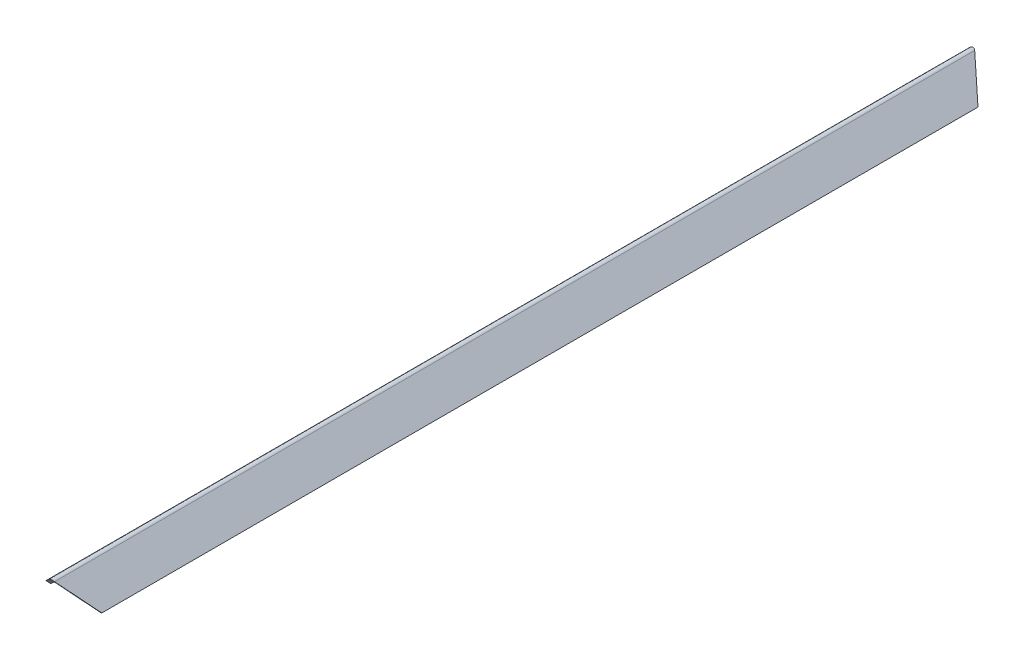
ISO-10303-21;
HEADER;
FILE_DESCRIPTION(('STEP AP214'),'2;1');
FILE_NAME('part.step','',(''),(''),'','','');
FILE_SCHEMA(('AUTOMOTIVE_DESIGN { 1 0 10303 214 1 1 1 1 }'));
ENDSEC;
DATA;
#1=APPLICATION_CONTEXT('core data for automotive mechanical design processes');
#2=APPLICATION_PROTOCOL_DEFINITION('international standard','automotive_design',2000,#1);
#3=PRODUCT_CONTEXT('',#1,'mechanical');
#4=PRODUCT('Part','Part','',(#3));
#5=PRODUCT_RELATED_PRODUCT_CATEGORY('part','',(#4));
#6=PRODUCT_DEFINITION_FORMATION('','',#4);
#7=PRODUCT_DEFINITION_CONTEXT('part definition',#1,'design');
#8=PRODUCT_DEFINITION('design','',#6,#7);
#9=PRODUCT_DEFINITION_SHAPE('','',#8);
#10=(LENGTH_UNIT() NAMED_UNIT(*) SI_UNIT(.MILLI.,.METRE.));
#11=(NAMED_UNIT(*) PLANE_ANGLE_UNIT() SI_UNIT($,.RADIAN.));
#12=(NAMED_UNIT(*) SI_UNIT($,.STERADIAN.) SOLID_ANGLE_UNIT());
#13=UNCERTAINTY_MEASURE_WITH_UNIT(LENGTH_MEASURE(1.E-05),#10,'distance_accuracy_value','');
#14=(GEOMETRIC_REPRESENTATION_CONTEXT(3) GLOBAL_UNCERTAINTY_ASSIGNED_CONTEXT((#13)) GLOBAL_UNIT_ASSIGNED_CONTEXT((#10,
#11,#12)) REPRESENTATION_CONTEXT('',''));
#15=CARTESIAN_POINT('',(0.,0.,0.));
#16=DIRECTION('',(0.,0.,1.));
#17=DIRECTION('',(1.,0.,0.));
#18=AXIS2_PLACEMENT_3D('',#15,#16,#17);
#19=CARTESIAN_POINT('',(-43.8794512837076,-42.2312162004582,1631.95));
#20=DIRECTION('',(-0.70654003930833,0.707673069188156,0.));
#21=DIRECTION('',(-0.707673069188156,-0.70654003930833,0.));
#22=AXIS2_PLACEMENT_3D('',#19,#20,#21);
#23=PLANE('',#22);
#24=DIRECTION('',(0.,0.,-1.));
#25=VECTOR('',#24,1.);
#26=CARTESIAN_POINT('',(-43.8794512837076,-42.2312162004582,1631.95));
#27=LINE('',#26,#25);
#28=CARTESIAN_POINT('',(-43.8794512837076,-42.2312162004582,1587.5));
#29=VERTEX_POINT('',#28);
#30=CARTESIAN_POINT('',(-43.8794512837076,-42.2312162004582,44.4499999999999));
#31=VERTEX_POINT('',#30);
#32=EDGE_CURVE('E126',#29,#31,#27,.T.);
#33=ORIENTED_EDGE('',*,*,#32,.T.);
#34=DIRECTION('',(0.603062993340039,0.602097450887426,-0.523252984414438));
#35=VECTOR('',#34,1.);
#36=CARTESIAN_POINT('',(-544.822237583646,-542.371961035667,479.097476046553));
#37=LINE('',#36,#35);
#38=CARTESIAN_POINT('',(-0.724615856394828,0.854525573122378,7.00632217756897));
#39=VERTEX_POINT('',#38);
#40=EDGE_CURVE('E56',#31,#39,#37,.T.);
#41=ORIENTED_EDGE('',*,*,#40,.T.);
#42=DIRECTION('',(0.,0.,-1.));
#43=VECTOR('',#42,1.);
#44=CARTESIAN_POINT('',(-0.724615856394798,0.854525573122322,1631.95));
#45=LINE('',#44,#43);
#46=CARTESIAN_POINT('',(-0.7246158563948,0.854525573122329,1624.94367782243));
#47=VERTEX_POINT('',#46);
#48=EDGE_CURVE('E11',#47,#39,#45,.T.);
#49=ORIENTED_EDGE('',*,*,#48,.F.);
#50=DIRECTION('',(-0.603062993340038,-0.602097450887426,-0.523252984414439));
#51=VECTOR('',#50,1.);
#52=CARTESIAN_POINT('',(-29.853053267309,-28.227275345072,1599.6701293293));
#53=LINE('',#52,#51);
#54=EDGE_CURVE('E176',#47,#29,#53,.T.);
#55=ORIENTED_EDGE('',*,*,#54,.T.);
#56=EDGE_LOOP('',(#33,#41,#49,#55));
#57=FACE_BOUND('',#56,.T.);
#58=ADVANCED_FACE('F41',(#57),#23,.F.);
#59=CARTESIAN_POINT('',(1.06999584344836,-0.942964022615596,1631.95));
#60=DIRECTION('',(0.,0.,-1.));
#61=DIRECTION('',(-1.,0.,0.));
#62=AXIS2_PLACEMENT_3D('',#59,#60,#61);
#63=CYLINDRICAL_SURFACE('',#62,2.54);
#64=ORIENTED_EDGE('',*,*,#48,.T.);
#65=CARTESIAN_POINT('',(1.06999584344836,-0.942964022615596,8.56168526678269));
#66=DIRECTION('',(0.00141766130242952,0.655147382128327,0.755499766993234));
#67=DIRECTION('',(0.00163480814450312,0.755497998229752,-0.655148915952067));
#68=AXIS2_PLACEMENT_3D('',#65,#66,#67);
#69=ELLIPSE('',#68,3.36201294953245,2.54);
#70=CARTESIAN_POINT('',(2.86992929570218,0.849196563787902,7.00419833701027));
#71=VERTEX_POINT('',#70);
#72=EDGE_CURVE('E161',#39,#71,#69,.F.);
#73=ORIENTED_EDGE('',*,*,#72,.T.);
#74=DIRECTION('',(0.,0.,-1.));
#75=VECTOR('',#74,1.);
#76=CARTESIAN_POINT('',(2.86992929570198,0.849196563787973,1631.95));
#77=LINE('',#76,#75);
#78=CARTESIAN_POINT('',(2.86992929570196,0.849196563787975,1624.94580166299));
#79=VERTEX_POINT('',#78);
#80=EDGE_CURVE('E49',#79,#71,#77,.T.);
#81=ORIENTED_EDGE('',*,*,#80,.F.);
#82=CARTESIAN_POINT('',(1.06999584344836,-0.942964022615596,1623.38831473322));
#83=DIRECTION('',(0.00141766130242964,0.655147382128328,-0.755499766993233));
#84=DIRECTION('',(-0.00163480814450325,-0.755497998229751,-0.655148915952068));
#85=AXIS2_PLACEMENT_3D('',#82,#83,#84);
#86=ELLIPSE('',#85,3.36201294953246,2.54);
#87=EDGE_CURVE('E132',#79,#47,#86,.F.);
#88=ORIENTED_EDGE('',*,*,#87,.T.);
#89=EDGE_LOOP('',(#64,#73,#81,#88));
#90=FACE_BOUND('',#89,.T.);
#91=ADVANCED_FACE('F159',(#90),#63,.F.);
#92=CARTESIAN_POINT('',(45.9578606188247,-42.4256134980323,1631.95));
#93=DIRECTION('',(0.708635217422683,0.705575034017153,0.));
#94=DIRECTION('',(-0.705575034017153,0.708635217422683,0.));
#95=AXIS2_PLACEMENT_3D('',#92,#93,#94);
#96=PLANE('',#95);
#97=ORIENTED_EDGE('',*,*,#80,.T.);
#98=DIRECTION('',(0.601498945856209,-0.604107735855584,0.522735938704533));
#99=VECTOR('',#98,1.);
#100=CARTESIAN_POINT('',(545.107732414767,-543.740372203091,478.238917811129));
#101=LINE('',#100,#99);
#102=CARTESIAN_POINT('',(45.9578606188247,-42.4256134980324,44.4499999999999));
#103=VERTEX_POINT('',#102);
#104=EDGE_CURVE('E154',#71,#103,#101,.T.);
#105=ORIENTED_EDGE('',*,*,#104,.T.);
#106=DIRECTION('',(0.,0.,-1.));
#107=VECTOR('',#106,1.);
#108=CARTESIAN_POINT('',(45.9578606188247,-42.4256134980323,1631.95));
#109=LINE('',#108,#107);
#110=CARTESIAN_POINT('',(45.9578606188247,-42.4256134980323,1587.5));
#111=VERTEX_POINT('',#110);
#112=EDGE_CURVE('E143',#111,#103,#109,.T.);
#113=ORIENTED_EDGE('',*,*,#112,.F.);
#114=DIRECTION('',(-0.601498945856208,0.604107735855584,0.522735938704534));
#115=VECTOR('',#114,1.);
#116=CARTESIAN_POINT('',(31.9816642085379,-28.3888002542904,1599.64608969871));
#117=LINE('',#116,#115);
#118=EDGE_CURVE('E155',#111,#79,#117,.T.);
#119=ORIENTED_EDGE('',*,*,#118,.T.);
#120=EDGE_LOOP('',(#97,#105,#113,#119));
#121=FACE_BOUND('',#120,.T.);
#122=ADVANCED_FACE('F152',(#121),#96,.F.);
#123=CARTESIAN_POINT('',(50.4576942494587,-37.9452120320234,1631.95));
#124=DIRECTION('',(-0.705575034017152,0.708635217422684,0.));
#125=DIRECTION('',(-0.708635217422684,-0.705575034017152,0.));
#126=AXIS2_PLACEMENT_3D('',#123,#124,#125);
#127=PLANE('',#126);
#128=ORIENTED_EDGE('',*,*,#112,.T.);
#129=DIRECTION('',(0.604107735855586,0.601498945856208,-0.522735938704532));
#130=VECTOR('',#129,1.);
#131=CARTESIAN_POINT('',(-452.086656871955,-538.319366349728,475.409169887911));
#132=LINE('',#131,#130);
#133=CARTESIAN_POINT('',(50.4576942494588,-37.9452120320234,40.5562826755692));
#134=VERTEX_POINT('',#133);
#135=EDGE_CURVE('E167',#103,#134,#132,.T.);
#136=ORIENTED_EDGE('',*,*,#135,.T.);
#137=DIRECTION('',(0.,0.,-1.));
#138=VECTOR('',#137,1.);
#139=CARTESIAN_POINT('',(50.4576942494587,-37.9452120320234,1631.95));
#140=LINE('',#139,#138);
#141=CARTESIAN_POINT('',(50.4576942494587,-37.9452120320234,1591.39371732443));
#142=VERTEX_POINT('',#141);
#143=EDGE_CURVE('E139',#142,#134,#140,.T.);
#144=ORIENTED_EDGE('',*,*,#143,.F.);
#145=DIRECTION('',(-0.604107735855585,-0.601498945856207,-0.522735938704533));
#146=VECTOR('',#145,1.);
#147=CARTESIAN_POINT('',(63.2649150768462,-25.1932981435001,1602.47583762193));
#148=LINE('',#147,#146);
#149=EDGE_CURVE('E184',#142,#111,#148,.T.);
#150=ORIENTED_EDGE('',*,*,#149,.T.);
#151=EDGE_LOOP('',(#128,#136,#144,#150));
#152=FACE_BOUND('',#151,.T.);
#153=ADVANCED_FACE('F192',(#152),#127,.F.);
#154=CARTESIAN_POINT('',(50.4576942494587,-37.9452120320234,1631.95));
#155=DIRECTION('',(-0.708635217422683,-0.705575034017153,0.));
#156=DIRECTION('',(0.705575034017153,-0.708635217422683,0.));
#157=AXIS2_PLACEMENT_3D('',#154,#155,#156);
#158=PLANE('',#157);
#159=ORIENTED_EDGE('',*,*,#143,.T.);
#160=DIRECTION('',(-0.601498945856208,0.604107735855584,-0.522735938704533));
#161=VECTOR('',#160,1.);
#162=CARTESIAN_POINT('',(550.831848567165,-540.489563153436,475.409169887912));
#163=LINE('',#162,#161);
#164=CARTESIAN_POINT('',(5.65367958936952,7.05312427431696,1.61910943125854));
#165=VERTEX_POINT('',#164);
#166=EDGE_CURVE('E200',#134,#165,#163,.T.);
#167=ORIENTED_EDGE('',*,*,#166,.T.);
#168=DIRECTION('',(0.,0.,-1.));
#169=VECTOR('',#168,1.);
#170=CARTESIAN_POINT('',(5.65367958936952,7.05312427431696,1631.95));
#171=LINE('',#170,#169);
#172=CARTESIAN_POINT('',(5.65367958936952,7.05312427431696,1630.33089056874));
#173=VERTEX_POINT('',#172);
#174=EDGE_CURVE('E130',#173,#165,#171,.T.);
#175=ORIENTED_EDGE('',*,*,#174,.F.);
#176=DIRECTION('',(0.601498945856208,-0.604107735855584,-0.522735938704534));
#177=VECTOR('',#176,1.);
#178=CARTESIAN_POINT('',(37.7057803609354,-25.137991204636,1602.47583762193));
#179=LINE('',#178,#177);
#180=EDGE_CURVE('E180',#173,#142,#179,.T.);
#181=ORIENTED_EDGE('',*,*,#180,.T.);
#182=EDGE_LOOP('',(#159,#167,#175,#181));
#183=FACE_BOUND('',#182,.T.);
#184=ADVANCED_FACE('F198',(#183),#158,.F.);
#185=CARTESIAN_POINT('',(1.13632766502265,2.5552801659182,1631.95));
#186=DIRECTION('',(0.,0.,-1.));
#187=DIRECTION('',(-1.,0.,0.));
#188=AXIS2_PLACEMENT_3D('',#185,#186,#187);
#189=CYLINDRICAL_SURFACE('',#188,6.37472117287162);
#190=CARTESIAN_POINT('',(1.13632766502265,2.5552801659182,5.52798537916832));
#191=DIRECTION('',(0.00141766130242952,0.655147382128327,0.755499766993234));
#192=DIRECTION('',(0.00163480814450312,0.755497998229752,-0.655148915952067));
#193=AXIS2_PLACEMENT_3D('',#190,#191,#192);
#194=ELLIPSE('',#193,8.43775398931223,6.37472117287162);
#195=CARTESIAN_POINT('',(-3.36151644337612,7.07263209026499,1.61910943125848));
#196=VERTEX_POINT('',#195);
#197=EDGE_CURVE('E203',#165,#196,#194,.T.);
#198=ORIENTED_EDGE('',*,*,#197,.T.);
#199=DIRECTION('',(0.,0.,-1.));
#200=VECTOR('',#199,1.);
#201=CARTESIAN_POINT('',(-3.36151644337611,7.07263209026506,1631.95));
#202=LINE('',#201,#200);
#203=CARTESIAN_POINT('',(-3.3615164433761,7.07263209026507,1630.33089056874));
#204=VERTEX_POINT('',#203);
#205=EDGE_CURVE('E120',#204,#196,#202,.T.);
#206=ORIENTED_EDGE('',*,*,#205,.F.);
#207=CARTESIAN_POINT('',(1.13632766502265,2.5552801659182,1626.42201462083));
#208=DIRECTION('',(0.00141766130242964,0.655147382128328,-0.755499766993233));
#209=DIRECTION('',(-0.00163480814450325,-0.755497998229751,-0.655148915952068));
#210=AXIS2_PLACEMENT_3D('',#207,#208,#209);
#211=ELLIPSE('',#210,8.43775398931224,6.37472117287162);
#212=EDGE_CURVE('E173',#204,#173,#211,.T.);
#213=ORIENTED_EDGE('',*,*,#212,.T.);
#214=ORIENTED_EDGE('',*,*,#174,.T.);
#215=EDGE_LOOP('',(#198,#206,#213,#214));
#216=FACE_BOUND('',#215,.T.);
#217=ADVANCED_FACE('F202',(#216),#189,.T.);
#218=CARTESIAN_POINT('',(-48.3598527497165,-37.7313825698242,1631.95));
#219=DIRECTION('',(0.705575034017153,-0.708635217422683,0.));
#220=DIRECTION('',(0.708635217422683,0.705575034017153,0.));
#221=AXIS2_PLACEMENT_3D('',#218,#219,#220);
#222=PLANE('',#221);
#223=ORIENTED_EDGE('',*,*,#205,.T.);
#224=DIRECTION('',(-0.604107735855584,-0.601498945856209,0.522735938704533));
#225=VECTOR('',#224,1.);
#226=CARTESIAN_POINT('',(-550.904203871129,-538.10553688753,475.409169887912));
#227=LINE('',#226,#225);
#228=CARTESIAN_POINT('',(-48.3598527497164,-37.7313825698242,40.5562826755689));
#229=VERTEX_POINT('',#228);
#230=EDGE_CURVE('E107',#196,#229,#227,.T.);
#231=ORIENTED_EDGE('',*,*,#230,.T.);
#232=DIRECTION('',(0.,0.,-1.));
#233=VECTOR('',#232,1.);
#234=CARTESIAN_POINT('',(-48.3598527497165,-37.7313825698242,1631.95));
#235=LINE('',#234,#233);
#236=CARTESIAN_POINT('',(-48.3598527497165,-37.7313825698242,1591.39371732443));
#237=VERTEX_POINT('',#236);
#238=EDGE_CURVE('E118',#237,#229,#235,.T.);
#239=ORIENTED_EDGE('',*,*,#238,.F.);
#240=DIRECTION('',(0.604107735855584,0.601498945856208,0.522735938704534));
#241=VECTOR('',#240,1.);
#242=CARTESIAN_POINT('',(-35.5526319223291,-24.9794686813009,1602.47583762193));
#243=LINE('',#242,#241);
#244=EDGE_CURVE('E64',#237,#204,#243,.T.);
#245=ORIENTED_EDGE('',*,*,#244,.T.);
#246=EDGE_LOOP('',(#223,#231,#239,#245));
#247=FACE_BOUND('',#246,.T.);
#248=ADVANCED_FACE('F117',(#247),#222,.F.);
#249=CARTESIAN_POINT('',(-43.8794512837076,-42.2312162004582,1631.95));
#250=DIRECTION('',(0.708635217422683,0.705575034017153,0.));
#251=DIRECTION('',(-0.705575034017153,0.708635217422683,0.));
#252=AXIS2_PLACEMENT_3D('',#249,#250,#251);
#253=PLANE('',#252);
#254=ORIENTED_EDGE('',*,*,#238,.T.);
#255=DIRECTION('',(0.601498945856208,-0.604107735855584,0.522735938704533));
#256=VECTOR('',#255,1.);
#257=CARTESIAN_POINT('',(455.270420512235,-543.545974905517,478.238917811129));
#258=LINE('',#257,#256);
#259=EDGE_CURVE('E104',#229,#31,#258,.T.);
#260=ORIENTED_EDGE('',*,*,#259,.T.);
#261=ORIENTED_EDGE('',*,*,#32,.F.);
#262=DIRECTION('',(-0.601498945856208,0.604107735855584,0.522735938704534));
#263=VECTOR('',#262,1.);
#264=CARTESIAN_POINT('',(-57.8556476939943,-28.1944029567162,1599.64608969871));
#265=LINE('',#264,#263);
#266=EDGE_CURVE('E124',#29,#237,#265,.T.);
#267=ORIENTED_EDGE('',*,*,#266,.T.);
#268=EDGE_LOOP('',(#254,#260,#261,#267));
#269=FACE_BOUND('',#268,.T.);
#270=ADVANCED_FACE('F123',(#269),#253,.F.);
#271=CARTESIAN_POINT('',(-1.73959199251768,-803.922021371478,927.063003524163));
#272=DIRECTION('',(0.00141766130242964,0.655147382128328,-0.755499766993233));
#273=DIRECTION('',(0.,0.755500526182331,0.655148040474991));
#274=AXIS2_PLACEMENT_3D('',#271,#272,#273);
#275=PLANE('',#274);
#276=ORIENTED_EDGE('',*,*,#118,.F.);
#277=ORIENTED_EDGE('',*,*,#149,.F.);
#278=ORIENTED_EDGE('',*,*,#180,.F.);
#279=ORIENTED_EDGE('',*,*,#212,.F.);
#280=ORIENTED_EDGE('',*,*,#244,.F.);
#281=ORIENTED_EDGE('',*,*,#266,.F.);
#282=ORIENTED_EDGE('',*,*,#54,.F.);
#283=ORIENTED_EDGE('',*,*,#87,.F.);
#284=EDGE_LOOP('',(#276,#277,#278,#279,#280,#281,#282,#283));
#285=FACE_BOUND('',#284,.T.);
#286=ADVANCED_FACE('F195',(#285),#275,.F.);
#287=CARTESIAN_POINT('',(0.00829627827775512,3.83397993989442,4.42125089752645));
#288=DIRECTION('',(0.00141766130242952,0.655147382128327,0.755499766993234));
#289=DIRECTION('',(0.,-0.755500526182332,0.65514804047499));
#290=AXIS2_PLACEMENT_3D('',#287,#288,#289);
#291=PLANE('',#290);
#292=ORIENTED_EDGE('',*,*,#40,.F.);
#293=ORIENTED_EDGE('',*,*,#259,.F.);
#294=ORIENTED_EDGE('',*,*,#230,.F.);
#295=ORIENTED_EDGE('',*,*,#197,.F.);
#296=ORIENTED_EDGE('',*,*,#166,.F.);
#297=ORIENTED_EDGE('',*,*,#135,.F.);
#298=ORIENTED_EDGE('',*,*,#104,.F.);
#299=ORIENTED_EDGE('',*,*,#72,.F.);
#300=EDGE_LOOP('',(#292,#293,#294,#295,#296,#297,#298,#299));
#301=FACE_BOUND('',#300,.T.);
#302=ADVANCED_FACE('F106',(#301),#291,.F.);
#303=CLOSED_SHELL('',(#58,#91,#122,#153,#184,#217,#248,#270,#286,#302));
#304=MANIFOLD_SOLID_BREP('B2',#303);
#305=ADVANCED_BREP_SHAPE_REPRESENTATION('',(#18,#304),#14);
#306=SHAPE_DEFINITION_REPRESENTATION(#9,#305);
ENDSEC;
END-ISO-10303-21;
